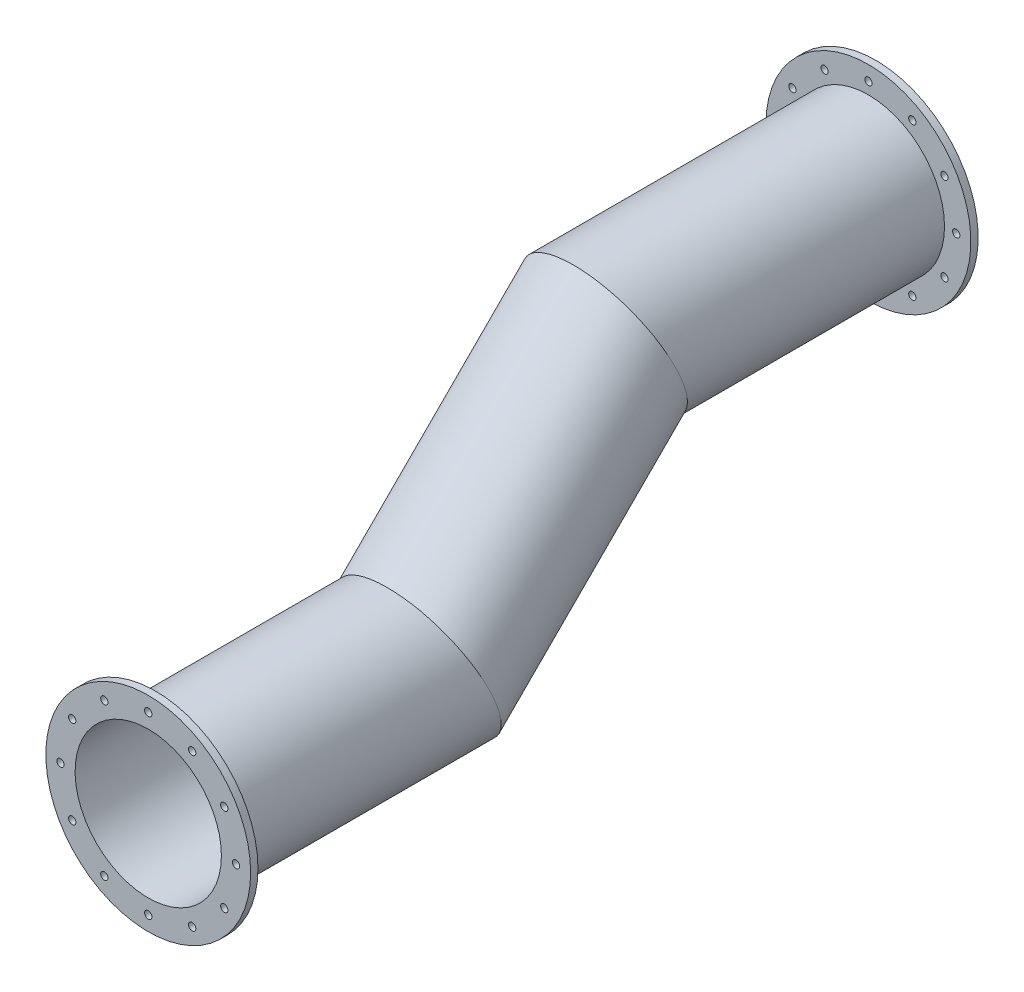
ISO-10303-21;
HEADER;
FILE_DESCRIPTION(('STEP AP214'),'2;1');
FILE_NAME('part.step','',(''),(''),'','','');
FILE_SCHEMA(('AUTOMOTIVE_DESIGN { 1 0 10303 214 1 1 1 1 }'));
ENDSEC;
DATA;
#1=APPLICATION_CONTEXT('core data for automotive mechanical design processes');
#2=APPLICATION_PROTOCOL_DEFINITION('international standard','automotive_design',2000,#1);
#3=PRODUCT_CONTEXT('',#1,'mechanical');
#4=PRODUCT('Part','Part','',(#3));
#5=PRODUCT_RELATED_PRODUCT_CATEGORY('part','',(#4));
#6=PRODUCT_DEFINITION_FORMATION('','',#4);
#7=PRODUCT_DEFINITION_CONTEXT('part definition',#1,'design');
#8=PRODUCT_DEFINITION('design','',#6,#7);
#9=PRODUCT_DEFINITION_SHAPE('','',#8);
#10=(LENGTH_UNIT() NAMED_UNIT(*) SI_UNIT(.MILLI.,.METRE.));
#11=(NAMED_UNIT(*) PLANE_ANGLE_UNIT() SI_UNIT($,.RADIAN.));
#12=(NAMED_UNIT(*) SI_UNIT($,.STERADIAN.) SOLID_ANGLE_UNIT());
#13=UNCERTAINTY_MEASURE_WITH_UNIT(LENGTH_MEASURE(1.E-05),#10,'distance_accuracy_value','');
#14=(GEOMETRIC_REPRESENTATION_CONTEXT(3) GLOBAL_UNCERTAINTY_ASSIGNED_CONTEXT((#13)) GLOBAL_UNIT_ASSIGNED_CONTEXT((#10,
#11,#12)) REPRESENTATION_CONTEXT('',''));
#15=CARTESIAN_POINT('',(0.,0.,0.));
#16=DIRECTION('',(0.,0.,1.));
#17=DIRECTION('',(1.,0.,0.));
#18=AXIS2_PLACEMENT_3D('',#15,#16,#17);
#19=CARTESIAN_POINT('',(0.,127.279220613579,-261.615728752538));
#20=DIRECTION('',(0.,0.,-1.));
#21=DIRECTION('',(-1.,0.,0.));
#22=AXIS2_PLACEMENT_3D('',#19,#20,#21);
#23=CYLINDRICAL_SURFACE('',#22,52.);
#24=CARTESIAN_POINT('',(0.,127.279220613579,-307.279220613579));
#25=DIRECTION('',(0.,0.38268343236509,-0.923879532511287));
#26=DIRECTION('',(0.,0.923879532511287,0.38268343236509));
#27=AXIS2_PLACEMENT_3D('',#24,#25,#26);
#28=ELLIPSE('',#27,56.2843944152045,52.);
#29=CARTESIAN_POINT('',(0.,179.279220613579,-285.740115370178));
#30=VERTEX_POINT('',#29);
#31=EDGE_CURVE('E51',#30,#30,#28,.T.);
#32=ORIENTED_EDGE('',*,*,#31,.T.);
#33=EDGE_LOOP('',(#32));
#34=FACE_BOUND('',#33,.T.);
#35=CARTESIAN_POINT('',(0.,127.279220613579,-487.279220613578));
#36=DIRECTION('',(0.,0.,1.));
#37=DIRECTION('',(1.,0.,0.));
#38=AXIS2_PLACEMENT_3D('',#35,#36,#37);
#39=CIRCLE('',#38,52.);
#40=CARTESIAN_POINT('',(52.,127.279220613579,-487.279220613578));
#41=VERTEX_POINT('',#40);
#42=EDGE_CURVE('E54',#41,#41,#39,.T.);
#43=ORIENTED_EDGE('',*,*,#42,.T.);
#44=EDGE_LOOP('',(#43));
#45=FACE_BOUND('',#44,.T.);
#46=ADVANCED_FACE('F37',(#34,#45),#23,.T.);
#47=CARTESIAN_POINT('',(0.,-32.2889647475984,-147.711035252402));
#48=DIRECTION('',(0.,0.707106781186548,-0.707106781186547));
#49=DIRECTION('',(0.,0.707106781186547,0.707106781186548));
#50=AXIS2_PLACEMENT_3D('',#47,#48,#49);
#51=CYLINDRICAL_SURFACE('',#50,52.);
#52=CARTESIAN_POINT('',(0.,0.,-180.));
#53=DIRECTION('',(0.,0.38268343236509,-0.923879532511287));
#54=DIRECTION('',(0.,-0.923879532511287,-0.38268343236509));
#55=AXIS2_PLACEMENT_3D('',#52,#53,#54);
#56=ELLIPSE('',#55,56.2843944152045,52.);
#57=CARTESIAN_POINT('',(0.,-52.,-201.539105243401));
#58=VERTEX_POINT('',#57);
#59=EDGE_CURVE('E10',#58,#58,#56,.T.);
#60=ORIENTED_EDGE('',*,*,#59,.T.);
#61=EDGE_LOOP('',(#60));
#62=FACE_BOUND('',#61,.T.);
#63=ORIENTED_EDGE('',*,*,#31,.F.);
#64=EDGE_LOOP('',(#63));
#65=FACE_BOUND('',#64,.T.);
#66=ADVANCED_FACE('F322',(#62,#65),#51,.T.);
#67=CARTESIAN_POINT('',(0.,0.,0.));
#68=DIRECTION('',(0.,0.,-1.));
#69=DIRECTION('',(-1.,0.,0.));
#70=AXIS2_PLACEMENT_3D('',#67,#68,#69);
#71=CYLINDRICAL_SURFACE('',#70,52.);
#72=CARTESIAN_POINT('',(0.,0.,0.));
#73=DIRECTION('',(0.,0.,1.));
#74=DIRECTION('',(1.,0.,0.));
#75=AXIS2_PLACEMENT_3D('',#72,#73,#74);
#76=CIRCLE('',#75,52.);
#77=CARTESIAN_POINT('',(52.,0.,0.));
#78=VERTEX_POINT('',#77);
#79=EDGE_CURVE('E41',#78,#78,#76,.T.);
#80=ORIENTED_EDGE('',*,*,#79,.F.);
#81=EDGE_LOOP('',(#80));
#82=FACE_BOUND('',#81,.T.);
#83=ORIENTED_EDGE('',*,*,#59,.F.);
#84=EDGE_LOOP('',(#83));
#85=FACE_BOUND('',#84,.T.);
#86=ADVANCED_FACE('F39',(#82,#85),#71,.T.);
#87=CARTESIAN_POINT('',(0.,127.279220613579,-261.615728752538));
#88=DIRECTION('',(0.,0.,-1.));
#89=DIRECTION('',(-1.,0.,0.));
#90=AXIS2_PLACEMENT_3D('',#87,#88,#89);
#91=CYLINDRICAL_SURFACE('',#90,50.);
#92=CARTESIAN_POINT('',(0.,127.279220613579,-307.279220613579));
#93=DIRECTION('',(0.,0.38268343236509,-0.923879532511287));
#94=DIRECTION('',(0.,0.923879532511287,0.38268343236509));
#95=AXIS2_PLACEMENT_3D('',#92,#93,#94);
#96=ELLIPSE('',#95,54.1196100146197,50.);
#97=CARTESIAN_POINT('',(0.,177.279220613579,-286.568542494924));
#98=VERTEX_POINT('',#97);
#99=EDGE_CURVE('E178',#98,#98,#96,.T.);
#100=ORIENTED_EDGE('',*,*,#99,.F.);
#101=EDGE_LOOP('',(#100));
#102=FACE_BOUND('',#101,.T.);
#103=CARTESIAN_POINT('',(0.,127.279220613579,-492.279220613578));
#104=DIRECTION('',(0.,0.,-1.));
#105=DIRECTION('',(-1.,0.,0.));
#106=AXIS2_PLACEMENT_3D('',#103,#104,#105);
#107=CIRCLE('',#106,50.);
#108=CARTESIAN_POINT('',(-50.,127.279220613579,-492.279220613578));
#109=VERTEX_POINT('',#108);
#110=EDGE_CURVE('E73',#109,#109,#107,.T.);
#111=ORIENTED_EDGE('',*,*,#110,.T.);
#112=EDGE_LOOP('',(#111));
#113=FACE_BOUND('',#112,.T.);
#114=ADVANCED_FACE('F191',(#102,#113),#91,.F.);
#115=CARTESIAN_POINT('',(0.,-32.2889647475984,-147.711035252402));
#116=DIRECTION('',(0.,0.707106781186548,-0.707106781186547));
#117=DIRECTION('',(0.,0.707106781186547,0.707106781186548));
#118=AXIS2_PLACEMENT_3D('',#115,#116,#117);
#119=CYLINDRICAL_SURFACE('',#118,50.);
#120=CARTESIAN_POINT('',(0.,0.,-180.));
#121=DIRECTION('',(0.,0.38268343236509,-0.923879532511287));
#122=DIRECTION('',(0.,-0.923879532511287,-0.38268343236509));
#123=AXIS2_PLACEMENT_3D('',#120,#121,#122);
#124=ELLIPSE('',#123,54.1196100146197,50.);
#125=CARTESIAN_POINT('',(0.,-50.,-200.710678118655));
#126=VERTEX_POINT('',#125);
#127=EDGE_CURVE('E182',#126,#126,#124,.T.);
#128=ORIENTED_EDGE('',*,*,#127,.F.);
#129=EDGE_LOOP('',(#128));
#130=FACE_BOUND('',#129,.T.);
#131=ORIENTED_EDGE('',*,*,#99,.T.);
#132=EDGE_LOOP('',(#131));
#133=FACE_BOUND('',#132,.T.);
#134=ADVANCED_FACE('F189',(#130,#133),#119,.F.);
#135=CARTESIAN_POINT('',(0.,0.,0.));
#136=DIRECTION('',(0.,0.,-1.));
#137=DIRECTION('',(-1.,0.,0.));
#138=AXIS2_PLACEMENT_3D('',#135,#136,#137);
#139=CYLINDRICAL_SURFACE('',#138,50.);
#140=ORIENTED_EDGE('',*,*,#127,.T.);
#141=EDGE_LOOP('',(#140));
#142=FACE_BOUND('',#141,.T.);
#143=CARTESIAN_POINT('',(0.,0.,5.));
#144=DIRECTION('',(0.,0.,1.));
#145=DIRECTION('',(1.,0.,0.));
#146=AXIS2_PLACEMENT_3D('',#143,#144,#145);
#147=CIRCLE('',#146,50.);
#148=CARTESIAN_POINT('',(50.,0.,5.));
#149=VERTEX_POINT('',#148);
#150=EDGE_CURVE('E166',#149,#149,#147,.T.);
#151=ORIENTED_EDGE('',*,*,#150,.T.);
#152=EDGE_LOOP('',(#151));
#153=FACE_BOUND('',#152,.T.);
#154=ADVANCED_FACE('F411',(#142,#153),#139,.F.);
#155=CARTESIAN_POINT('',(0.,0.,5.));
#156=DIRECTION('',(0.,0.,1.));
#157=DIRECTION('',(1.,0.,0.));
#158=AXIS2_PLACEMENT_3D('',#155,#156,#157);
#159=PLANE('',#158);
#160=CARTESIAN_POINT('',(51.9615242270663,-30.,5.));
#161=DIRECTION('',(0.,0.,1.));
#162=DIRECTION('',(1.,0.,0.));
#163=AXIS2_PLACEMENT_3D('',#160,#161,#162);
#164=CIRCLE('',#163,2.5);
#165=CARTESIAN_POINT('',(54.4615242270663,-30.,5.));
#166=VERTEX_POINT('',#165);
#167=EDGE_CURVE('E82',#166,#166,#164,.T.);
#168=ORIENTED_EDGE('',*,*,#167,.F.);
#169=EDGE_LOOP('',(#168));
#170=FACE_BOUND('',#169,.T.);
#171=CARTESIAN_POINT('',(51.9615242270663,30.,5.));
#172=DIRECTION('',(0.,0.,1.));
#173=DIRECTION('',(1.,0.,0.));
#174=AXIS2_PLACEMENT_3D('',#171,#172,#173);
#175=CIRCLE('',#174,2.50000000000001);
#176=CARTESIAN_POINT('',(54.4615242270663,30.,5.));
#177=VERTEX_POINT('',#176);
#178=EDGE_CURVE('E98',#177,#177,#175,.T.);
#179=ORIENTED_EDGE('',*,*,#178,.F.);
#180=EDGE_LOOP('',(#179));
#181=FACE_BOUND('',#180,.T.);
#182=CARTESIAN_POINT('',(0.,60.,5.));
#183=DIRECTION('',(0.,0.,1.));
#184=DIRECTION('',(1.,0.,0.));
#185=AXIS2_PLACEMENT_3D('',#182,#183,#184);
#186=CIRCLE('',#185,2.5);
#187=CARTESIAN_POINT('',(2.5,60.,5.));
#188=VERTEX_POINT('',#187);
#189=EDGE_CURVE('E114',#188,#188,#186,.T.);
#190=ORIENTED_EDGE('',*,*,#189,.F.);
#191=EDGE_LOOP('',(#190));
#192=FACE_BOUND('',#191,.T.);
#193=CARTESIAN_POINT('',(-51.9615242270663,30.,5.));
#194=DIRECTION('',(0.,0.,1.));
#195=DIRECTION('',(1.,0.,0.));
#196=AXIS2_PLACEMENT_3D('',#193,#194,#195);
#197=CIRCLE('',#196,2.5);
#198=CARTESIAN_POINT('',(-49.4615242270663,30.,5.));
#199=VERTEX_POINT('',#198);
#200=EDGE_CURVE('E130',#199,#199,#197,.T.);
#201=ORIENTED_EDGE('',*,*,#200,.F.);
#202=EDGE_LOOP('',(#201));
#203=FACE_BOUND('',#202,.T.);
#204=CARTESIAN_POINT('',(-51.9615242270663,-30.,5.));
#205=DIRECTION('',(0.,0.,1.));
#206=DIRECTION('',(1.,0.,0.));
#207=AXIS2_PLACEMENT_3D('',#204,#205,#206);
#208=CIRCLE('',#207,2.50000000000001);
#209=CARTESIAN_POINT('',(-49.4615242270663,-30.,5.));
#210=VERTEX_POINT('',#209);
#211=EDGE_CURVE('E146',#210,#210,#208,.T.);
#212=ORIENTED_EDGE('',*,*,#211,.F.);
#213=EDGE_LOOP('',(#212));
#214=FACE_BOUND('',#213,.T.);
#215=CARTESIAN_POINT('',(0.,-60.,5.));
#216=DIRECTION('',(0.,0.,1.));
#217=DIRECTION('',(1.,0.,0.));
#218=AXIS2_PLACEMENT_3D('',#215,#216,#217);
#219=CIRCLE('',#218,2.5);
#220=CARTESIAN_POINT('',(2.5,-60.,5.));
#221=VERTEX_POINT('',#220);
#222=EDGE_CURVE('E162',#221,#221,#219,.T.);
#223=ORIENTED_EDGE('',*,*,#222,.F.);
#224=EDGE_LOOP('',(#223));
#225=FACE_BOUND('',#224,.T.);
#226=CARTESIAN_POINT('',(0.,0.,5.));
#227=DIRECTION('',(0.,0.,1.));
#228=DIRECTION('',(1.,0.,0.));
#229=AXIS2_PLACEMENT_3D('',#226,#227,#228);
#230=CIRCLE('',#229,70.0000000000001);
#231=CARTESIAN_POINT('',(70.0000000000001,0.,5.));
#232=VERTEX_POINT('',#231);
#233=EDGE_CURVE('E174',#232,#232,#230,.T.);
#234=ORIENTED_EDGE('',*,*,#233,.T.);
#235=EDGE_LOOP('',(#234));
#236=FACE_BOUND('',#235,.T.);
#237=ORIENTED_EDGE('',*,*,#150,.F.);
#238=EDGE_LOOP('',(#237));
#239=FACE_BOUND('',#238,.T.);
#240=CARTESIAN_POINT('',(-30.,-51.9615242270663,5.));
#241=DIRECTION('',(0.,0.,1.));
#242=DIRECTION('',(1.,0.,0.));
#243=AXIS2_PLACEMENT_3D('',#240,#241,#242);
#244=CIRCLE('',#243,2.5);
#245=CARTESIAN_POINT('',(-27.5,-51.9615242270663,5.));
#246=VERTEX_POINT('',#245);
#247=EDGE_CURVE('E154',#246,#246,#244,.T.);
#248=ORIENTED_EDGE('',*,*,#247,.F.);
#249=EDGE_LOOP('',(#248));
#250=FACE_BOUND('',#249,.T.);
#251=CARTESIAN_POINT('',(-60.,0.,5.));
#252=DIRECTION('',(0.,0.,1.));
#253=DIRECTION('',(1.,0.,0.));
#254=AXIS2_PLACEMENT_3D('',#251,#252,#253);
#255=CIRCLE('',#254,2.5);
#256=CARTESIAN_POINT('',(-57.5,0.,5.));
#257=VERTEX_POINT('',#256);
#258=EDGE_CURVE('E138',#257,#257,#255,.T.);
#259=ORIENTED_EDGE('',*,*,#258,.F.);
#260=EDGE_LOOP('',(#259));
#261=FACE_BOUND('',#260,.T.);
#262=CARTESIAN_POINT('',(-30.,51.9615242270663,5.));
#263=DIRECTION('',(0.,0.,1.));
#264=DIRECTION('',(1.,0.,0.));
#265=AXIS2_PLACEMENT_3D('',#262,#263,#264);
#266=CIRCLE('',#265,2.5);
#267=CARTESIAN_POINT('',(-27.5,51.9615242270663,5.));
#268=VERTEX_POINT('',#267);
#269=EDGE_CURVE('E122',#268,#268,#266,.T.);
#270=ORIENTED_EDGE('',*,*,#269,.F.);
#271=EDGE_LOOP('',(#270));
#272=FACE_BOUND('',#271,.T.);
#273=CARTESIAN_POINT('',(30.,51.9615242270663,5.));
#274=DIRECTION('',(0.,0.,1.));
#275=DIRECTION('',(1.,0.,0.));
#276=AXIS2_PLACEMENT_3D('',#273,#274,#275);
#277=CIRCLE('',#276,2.50000000000001);
#278=CARTESIAN_POINT('',(32.5,51.9615242270663,5.));
#279=VERTEX_POINT('',#278);
#280=EDGE_CURVE('E106',#279,#279,#277,.T.);
#281=ORIENTED_EDGE('',*,*,#280,.F.);
#282=EDGE_LOOP('',(#281));
#283=FACE_BOUND('',#282,.T.);
#284=CARTESIAN_POINT('',(60.,0.,5.));
#285=DIRECTION('',(0.,0.,1.));
#286=DIRECTION('',(1.,0.,0.));
#287=AXIS2_PLACEMENT_3D('',#284,#285,#286);
#288=CIRCLE('',#287,2.5);
#289=CARTESIAN_POINT('',(62.5,0.,5.));
#290=VERTEX_POINT('',#289);
#291=EDGE_CURVE('E90',#290,#290,#288,.T.);
#292=ORIENTED_EDGE('',*,*,#291,.F.);
#293=EDGE_LOOP('',(#292));
#294=FACE_BOUND('',#293,.T.);
#295=CARTESIAN_POINT('',(30.,-51.9615242270663,5.));
#296=DIRECTION('',(0.,0.,1.));
#297=DIRECTION('',(1.,0.,0.));
#298=AXIS2_PLACEMENT_3D('',#295,#296,#297);
#299=CIRCLE('',#298,2.5);
#300=CARTESIAN_POINT('',(32.5,-51.9615242270663,5.));
#301=VERTEX_POINT('',#300);
#302=EDGE_CURVE('E64',#301,#301,#299,.T.);
#303=ORIENTED_EDGE('',*,*,#302,.F.);
#304=EDGE_LOOP('',(#303));
#305=FACE_BOUND('',#304,.T.);
#306=ADVANCED_FACE('F195',(#170,#181,#192,#203,#214,#225,#236,#239,#250,#261,#272,#283,#294,
#305),#159,.T.);
#307=CARTESIAN_POINT('',(0.,0.,0.));
#308=DIRECTION('',(0.,0.,1.));
#309=DIRECTION('',(1.,0.,0.));
#310=AXIS2_PLACEMENT_3D('',#307,#308,#309);
#311=PLANE('',#310);
#312=ORIENTED_EDGE('',*,*,#79,.T.);
#313=EDGE_LOOP('',(#312));
#314=FACE_BOUND('',#313,.T.);
#315=CARTESIAN_POINT('',(0.,0.,0.));
#316=DIRECTION('',(0.,0.,1.));
#317=DIRECTION('',(1.,0.,0.));
#318=AXIS2_PLACEMENT_3D('',#315,#316,#317);
#319=CIRCLE('',#318,70.0000000000001);
#320=CARTESIAN_POINT('',(70.0000000000001,0.,0.));
#321=VERTEX_POINT('',#320);
#322=EDGE_CURVE('E173',#321,#321,#319,.T.);
#323=ORIENTED_EDGE('',*,*,#322,.F.);
#324=EDGE_LOOP('',(#323));
#325=FACE_BOUND('',#324,.T.);
#326=CARTESIAN_POINT('',(0.,-60.,0.));
#327=DIRECTION('',(0.,0.,1.));
#328=DIRECTION('',(1.,0.,0.));
#329=AXIS2_PLACEMENT_3D('',#326,#327,#328);
#330=CIRCLE('',#329,2.5);
#331=CARTESIAN_POINT('',(2.5,-60.,0.));
#332=VERTEX_POINT('',#331);
#333=EDGE_CURVE('E158',#332,#332,#330,.T.);
#334=ORIENTED_EDGE('',*,*,#333,.T.);
#335=EDGE_LOOP('',(#334));
#336=FACE_BOUND('',#335,.T.);
#337=CARTESIAN_POINT('',(-30.,-51.9615242270663,0.));
#338=DIRECTION('',(0.,0.,1.));
#339=DIRECTION('',(1.,0.,0.));
#340=AXIS2_PLACEMENT_3D('',#337,#338,#339);
#341=CIRCLE('',#340,2.5);
#342=CARTESIAN_POINT('',(-27.5,-51.9615242270663,0.));
#343=VERTEX_POINT('',#342);
#344=EDGE_CURVE('E150',#343,#343,#341,.T.);
#345=ORIENTED_EDGE('',*,*,#344,.T.);
#346=EDGE_LOOP('',(#345));
#347=FACE_BOUND('',#346,.T.);
#348=CARTESIAN_POINT('',(-51.9615242270663,-30.,0.));
#349=DIRECTION('',(0.,0.,1.));
#350=DIRECTION('',(1.,0.,0.));
#351=AXIS2_PLACEMENT_3D('',#348,#349,#350);
#352=CIRCLE('',#351,2.50000000000001);
#353=CARTESIAN_POINT('',(-49.4615242270663,-30.,0.));
#354=VERTEX_POINT('',#353);
#355=EDGE_CURVE('E142',#354,#354,#352,.T.);
#356=ORIENTED_EDGE('',*,*,#355,.T.);
#357=EDGE_LOOP('',(#356));
#358=FACE_BOUND('',#357,.T.);
#359=CARTESIAN_POINT('',(-60.,0.,0.));
#360=DIRECTION('',(0.,0.,1.));
#361=DIRECTION('',(1.,0.,0.));
#362=AXIS2_PLACEMENT_3D('',#359,#360,#361);
#363=CIRCLE('',#362,2.5);
#364=CARTESIAN_POINT('',(-57.5,0.,0.));
#365=VERTEX_POINT('',#364);
#366=EDGE_CURVE('E134',#365,#365,#363,.T.);
#367=ORIENTED_EDGE('',*,*,#366,.T.);
#368=EDGE_LOOP('',(#367));
#369=FACE_BOUND('',#368,.T.);
#370=CARTESIAN_POINT('',(-51.9615242270663,30.,0.));
#371=DIRECTION('',(0.,0.,1.));
#372=DIRECTION('',(1.,0.,0.));
#373=AXIS2_PLACEMENT_3D('',#370,#371,#372);
#374=CIRCLE('',#373,2.5);
#375=CARTESIAN_POINT('',(-49.4615242270663,30.,0.));
#376=VERTEX_POINT('',#375);
#377=EDGE_CURVE('E126',#376,#376,#374,.T.);
#378=ORIENTED_EDGE('',*,*,#377,.T.);
#379=EDGE_LOOP('',(#378));
#380=FACE_BOUND('',#379,.T.);
#381=CARTESIAN_POINT('',(-30.,51.9615242270663,0.));
#382=DIRECTION('',(0.,0.,1.));
#383=DIRECTION('',(1.,0.,0.));
#384=AXIS2_PLACEMENT_3D('',#381,#382,#383);
#385=CIRCLE('',#384,2.5);
#386=CARTESIAN_POINT('',(-27.5,51.9615242270663,0.));
#387=VERTEX_POINT('',#386);
#388=EDGE_CURVE('E118',#387,#387,#385,.T.);
#389=ORIENTED_EDGE('',*,*,#388,.T.);
#390=EDGE_LOOP('',(#389));
#391=FACE_BOUND('',#390,.T.);
#392=CARTESIAN_POINT('',(0.,60.,0.));
#393=DIRECTION('',(0.,0.,1.));
#394=DIRECTION('',(1.,0.,0.));
#395=AXIS2_PLACEMENT_3D('',#392,#393,#394);
#396=CIRCLE('',#395,2.5);
#397=CARTESIAN_POINT('',(2.5,60.,0.));
#398=VERTEX_POINT('',#397);
#399=EDGE_CURVE('E110',#398,#398,#396,.T.);
#400=ORIENTED_EDGE('',*,*,#399,.T.);
#401=EDGE_LOOP('',(#400));
#402=FACE_BOUND('',#401,.T.);
#403=CARTESIAN_POINT('',(30.,51.9615242270663,0.));
#404=DIRECTION('',(0.,0.,1.));
#405=DIRECTION('',(1.,0.,0.));
#406=AXIS2_PLACEMENT_3D('',#403,#404,#405);
#407=CIRCLE('',#406,2.50000000000001);
#408=CARTESIAN_POINT('',(32.5,51.9615242270663,0.));
#409=VERTEX_POINT('',#408);
#410=EDGE_CURVE('E102',#409,#409,#407,.T.);
#411=ORIENTED_EDGE('',*,*,#410,.T.);
#412=EDGE_LOOP('',(#411));
#413=FACE_BOUND('',#412,.T.);
#414=CARTESIAN_POINT('',(51.9615242270663,30.,0.));
#415=DIRECTION('',(0.,0.,1.));
#416=DIRECTION('',(1.,0.,0.));
#417=AXIS2_PLACEMENT_3D('',#414,#415,#416);
#418=CIRCLE('',#417,2.50000000000001);
#419=CARTESIAN_POINT('',(54.4615242270663,30.,0.));
#420=VERTEX_POINT('',#419);
#421=EDGE_CURVE('E94',#420,#420,#418,.T.);
#422=ORIENTED_EDGE('',*,*,#421,.T.);
#423=EDGE_LOOP('',(#422));
#424=FACE_BOUND('',#423,.T.);
#425=CARTESIAN_POINT('',(60.,0.,0.));
#426=DIRECTION('',(0.,0.,1.));
#427=DIRECTION('',(1.,0.,0.));
#428=AXIS2_PLACEMENT_3D('',#425,#426,#427);
#429=CIRCLE('',#428,2.5);
#430=CARTESIAN_POINT('',(62.5,0.,0.));
#431=VERTEX_POINT('',#430);
#432=EDGE_CURVE('E86',#431,#431,#429,.T.);
#433=ORIENTED_EDGE('',*,*,#432,.T.);
#434=EDGE_LOOP('',(#433));
#435=FACE_BOUND('',#434,.T.);
#436=CARTESIAN_POINT('',(51.9615242270663,-30.,0.));
#437=DIRECTION('',(0.,0.,1.));
#438=DIRECTION('',(1.,0.,0.));
#439=AXIS2_PLACEMENT_3D('',#436,#437,#438);
#440=CIRCLE('',#439,2.5);
#441=CARTESIAN_POINT('',(54.4615242270663,-30.,0.));
#442=VERTEX_POINT('',#441);
#443=EDGE_CURVE('E80',#442,#442,#440,.T.);
#444=ORIENTED_EDGE('',*,*,#443,.T.);
#445=EDGE_LOOP('',(#444));
#446=FACE_BOUND('',#445,.T.);
#447=CARTESIAN_POINT('',(30.,-51.9615242270663,0.));
#448=DIRECTION('',(0.,0.,1.));
#449=DIRECTION('',(1.,0.,0.));
#450=AXIS2_PLACEMENT_3D('',#447,#448,#449);
#451=CIRCLE('',#450,2.5);
#452=CARTESIAN_POINT('',(32.5,-51.9615242270663,0.));
#453=VERTEX_POINT('',#452);
#454=EDGE_CURVE('E57',#453,#453,#451,.T.);
#455=ORIENTED_EDGE('',*,*,#454,.T.);
#456=EDGE_LOOP('',(#455));
#457=FACE_BOUND('',#456,.T.);
#458=ADVANCED_FACE('F331',(#314,#325,#336,#347,#358,#369,#380,#391,#402,#413,#424,#435,#446,
#457),#311,.F.);
#459=CARTESIAN_POINT('',(0.,0.,5.));
#460=DIRECTION('',(0.,0.,-1.));
#461=DIRECTION('',(-1.,0.,0.));
#462=AXIS2_PLACEMENT_3D('',#459,#460,#461);
#463=CYLINDRICAL_SURFACE('',#462,70.0000000000001);
#464=ORIENTED_EDGE('',*,*,#233,.F.);
#465=EDGE_LOOP('',(#464));
#466=FACE_BOUND('',#465,.T.);
#467=ORIENTED_EDGE('',*,*,#322,.T.);
#468=EDGE_LOOP('',(#467));
#469=FACE_BOUND('',#468,.T.);
#470=ADVANCED_FACE('F334',(#466,#469),#463,.T.);
#471=CARTESIAN_POINT('',(0.,-60.,5.));
#472=DIRECTION('',(0.,0.,-1.));
#473=DIRECTION('',(-1.,0.,0.));
#474=AXIS2_PLACEMENT_3D('',#471,#472,#473);
#475=CYLINDRICAL_SURFACE('',#474,2.5);
#476=ORIENTED_EDGE('',*,*,#222,.T.);
#477=EDGE_LOOP('',(#476));
#478=FACE_BOUND('',#477,.T.);
#479=ORIENTED_EDGE('',*,*,#333,.F.);
#480=EDGE_LOOP('',(#479));
#481=FACE_BOUND('',#480,.T.);
#482=ADVANCED_FACE('F405',(#478,#481),#475,.F.);
#483=CARTESIAN_POINT('',(-30.,-51.9615242270663,5.));
#484=DIRECTION('',(0.,0.,-1.));
#485=DIRECTION('',(-1.,0.,0.));
#486=AXIS2_PLACEMENT_3D('',#483,#484,#485);
#487=CYLINDRICAL_SURFACE('',#486,2.5);
#488=ORIENTED_EDGE('',*,*,#247,.T.);
#489=EDGE_LOOP('',(#488));
#490=FACE_BOUND('',#489,.T.);
#491=ORIENTED_EDGE('',*,*,#344,.F.);
#492=EDGE_LOOP('',(#491));
#493=FACE_BOUND('',#492,.T.);
#494=ADVANCED_FACE('F401',(#490,#493),#487,.F.);
#495=CARTESIAN_POINT('',(-51.9615242270663,-30.,5.));
#496=DIRECTION('',(0.,0.,-1.));
#497=DIRECTION('',(-1.,0.,0.));
#498=AXIS2_PLACEMENT_3D('',#495,#496,#497);
#499=CYLINDRICAL_SURFACE('',#498,2.50000000000001);
#500=ORIENTED_EDGE('',*,*,#211,.T.);
#501=EDGE_LOOP('',(#500));
#502=FACE_BOUND('',#501,.T.);
#503=ORIENTED_EDGE('',*,*,#355,.F.);
#504=EDGE_LOOP('',(#503));
#505=FACE_BOUND('',#504,.T.);
#506=ADVANCED_FACE('F397',(#502,#505),#499,.F.);
#507=CARTESIAN_POINT('',(-60.,0.,5.));
#508=DIRECTION('',(0.,0.,-1.));
#509=DIRECTION('',(-1.,0.,0.));
#510=AXIS2_PLACEMENT_3D('',#507,#508,#509);
#511=CYLINDRICAL_SURFACE('',#510,2.5);
#512=ORIENTED_EDGE('',*,*,#258,.T.);
#513=EDGE_LOOP('',(#512));
#514=FACE_BOUND('',#513,.T.);
#515=ORIENTED_EDGE('',*,*,#366,.F.);
#516=EDGE_LOOP('',(#515));
#517=FACE_BOUND('',#516,.T.);
#518=ADVANCED_FACE('F393',(#514,#517),#511,.F.);
#519=CARTESIAN_POINT('',(-51.9615242270663,30.,5.));
#520=DIRECTION('',(0.,0.,-1.));
#521=DIRECTION('',(-1.,0.,0.));
#522=AXIS2_PLACEMENT_3D('',#519,#520,#521);
#523=CYLINDRICAL_SURFACE('',#522,2.5);
#524=ORIENTED_EDGE('',*,*,#200,.T.);
#525=EDGE_LOOP('',(#524));
#526=FACE_BOUND('',#525,.T.);
#527=ORIENTED_EDGE('',*,*,#377,.F.);
#528=EDGE_LOOP('',(#527));
#529=FACE_BOUND('',#528,.T.);
#530=ADVANCED_FACE('F389',(#526,#529),#523,.F.);
#531=CARTESIAN_POINT('',(-30.,51.9615242270663,5.));
#532=DIRECTION('',(0.,0.,-1.));
#533=DIRECTION('',(-1.,0.,0.));
#534=AXIS2_PLACEMENT_3D('',#531,#532,#533);
#535=CYLINDRICAL_SURFACE('',#534,2.5);
#536=ORIENTED_EDGE('',*,*,#269,.T.);
#537=EDGE_LOOP('',(#536));
#538=FACE_BOUND('',#537,.T.);
#539=ORIENTED_EDGE('',*,*,#388,.F.);
#540=EDGE_LOOP('',(#539));
#541=FACE_BOUND('',#540,.T.);
#542=ADVANCED_FACE('F385',(#538,#541),#535,.F.);
#543=CARTESIAN_POINT('',(0.,60.,5.));
#544=DIRECTION('',(0.,0.,-1.));
#545=DIRECTION('',(-1.,0.,0.));
#546=AXIS2_PLACEMENT_3D('',#543,#544,#545);
#547=CYLINDRICAL_SURFACE('',#546,2.5);
#548=ORIENTED_EDGE('',*,*,#189,.T.);
#549=EDGE_LOOP('',(#548));
#550=FACE_BOUND('',#549,.T.);
#551=ORIENTED_EDGE('',*,*,#399,.F.);
#552=EDGE_LOOP('',(#551));
#553=FACE_BOUND('',#552,.T.);
#554=ADVANCED_FACE('F381',(#550,#553),#547,.F.);
#555=CARTESIAN_POINT('',(30.,51.9615242270663,5.));
#556=DIRECTION('',(0.,0.,-1.));
#557=DIRECTION('',(-1.,0.,0.));
#558=AXIS2_PLACEMENT_3D('',#555,#556,#557);
#559=CYLINDRICAL_SURFACE('',#558,2.50000000000001);
#560=ORIENTED_EDGE('',*,*,#280,.T.);
#561=EDGE_LOOP('',(#560));
#562=FACE_BOUND('',#561,.T.);
#563=ORIENTED_EDGE('',*,*,#410,.F.);
#564=EDGE_LOOP('',(#563));
#565=FACE_BOUND('',#564,.T.);
#566=ADVANCED_FACE('F377',(#562,#565),#559,.F.);
#567=CARTESIAN_POINT('',(51.9615242270663,30.,5.));
#568=DIRECTION('',(0.,0.,-1.));
#569=DIRECTION('',(-1.,0.,0.));
#570=AXIS2_PLACEMENT_3D('',#567,#568,#569);
#571=CYLINDRICAL_SURFACE('',#570,2.50000000000001);
#572=ORIENTED_EDGE('',*,*,#178,.T.);
#573=EDGE_LOOP('',(#572));
#574=FACE_BOUND('',#573,.T.);
#575=ORIENTED_EDGE('',*,*,#421,.F.);
#576=EDGE_LOOP('',(#575));
#577=FACE_BOUND('',#576,.T.);
#578=ADVANCED_FACE('F370',(#574,#577),#571,.F.);
#579=CARTESIAN_POINT('',(60.,0.,5.));
#580=DIRECTION('',(0.,0.,-1.));
#581=DIRECTION('',(-1.,0.,0.));
#582=AXIS2_PLACEMENT_3D('',#579,#580,#581);
#583=CYLINDRICAL_SURFACE('',#582,2.5);
#584=ORIENTED_EDGE('',*,*,#291,.T.);
#585=EDGE_LOOP('',(#584));
#586=FACE_BOUND('',#585,.T.);
#587=ORIENTED_EDGE('',*,*,#432,.F.);
#588=EDGE_LOOP('',(#587));
#589=FACE_BOUND('',#588,.T.);
#590=ADVANCED_FACE('F364',(#586,#589),#583,.F.);
#591=CARTESIAN_POINT('',(51.9615242270663,-30.,5.));
#592=DIRECTION('',(0.,0.,-1.));
#593=DIRECTION('',(-1.,0.,0.));
#594=AXIS2_PLACEMENT_3D('',#591,#592,#593);
#595=CYLINDRICAL_SURFACE('',#594,2.5);
#596=ORIENTED_EDGE('',*,*,#167,.T.);
#597=EDGE_LOOP('',(#596));
#598=FACE_BOUND('',#597,.T.);
#599=ORIENTED_EDGE('',*,*,#443,.F.);
#600=EDGE_LOOP('',(#599));
#601=FACE_BOUND('',#600,.T.);
#602=ADVANCED_FACE('F315',(#598,#601),#595,.F.);
#603=CARTESIAN_POINT('',(30.,-51.9615242270663,5.));
#604=DIRECTION('',(0.,0.,-1.));
#605=DIRECTION('',(-1.,0.,0.));
#606=AXIS2_PLACEMENT_3D('',#603,#604,#605);
#607=CYLINDRICAL_SURFACE('',#606,2.5);
#608=ORIENTED_EDGE('',*,*,#302,.T.);
#609=EDGE_LOOP('',(#608));
#610=FACE_BOUND('',#609,.T.);
#611=ORIENTED_EDGE('',*,*,#454,.F.);
#612=EDGE_LOOP('',(#611));
#613=FACE_BOUND('',#612,.T.);
#614=ADVANCED_FACE('F305',(#610,#613),#607,.F.);
#615=CARTESIAN_POINT('',(0.,127.279220613579,-492.279220613578));
#616=DIRECTION('',(0.,0.,-1.));
#617=DIRECTION('',(-1.,0.,0.));
#618=AXIS2_PLACEMENT_3D('',#615,#616,#617);
#619=PLANE('',#618);
#620=CARTESIAN_POINT('',(-51.961524227066,97.279220613578,-492.279220613578));
#621=DIRECTION('',(0.,0.,-1.));
#622=DIRECTION('',(-1.,0.,0.));
#623=AXIS2_PLACEMENT_3D('',#620,#621,#622);
#624=CIRCLE('',#623,2.49999999999999);
#625=CARTESIAN_POINT('',(-54.461524227066,97.279220613578,-492.279220613578));
#626=VERTEX_POINT('',#625);
#627=EDGE_CURVE('E279',#626,#626,#624,.T.);
#628=ORIENTED_EDGE('',*,*,#627,.F.);
#629=EDGE_LOOP('',(#628));
#630=FACE_BOUND('',#629,.T.);
#631=CARTESIAN_POINT('',(-51.9615242270666,157.279220613578,-492.279220613578));
#632=DIRECTION('',(0.,0.,-1.));
#633=DIRECTION('',(-1.,0.,0.));
#634=AXIS2_PLACEMENT_3D('',#631,#632,#633);
#635=CIRCLE('',#634,2.50000000000001);
#636=CARTESIAN_POINT('',(-54.4615242270666,157.279220613578,-492.279220613578));
#637=VERTEX_POINT('',#636);
#638=EDGE_CURVE('E263',#637,#637,#635,.T.);
#639=ORIENTED_EDGE('',*,*,#638,.F.);
#640=EDGE_LOOP('',(#639));
#641=FACE_BOUND('',#640,.T.);
#642=CARTESIAN_POINT('',(-4.2632564145606E-13,187.279220613579,-492.279220613578));
#643=DIRECTION('',(0.,0.,-1.));
#644=DIRECTION('',(-1.,0.,0.));
#645=AXIS2_PLACEMENT_3D('',#642,#643,#644);
#646=CIRCLE('',#645,2.50000000000001);
#647=CARTESIAN_POINT('',(-2.50000000000043,187.279220613579,-492.279220613578));
#648=VERTEX_POINT('',#647);
#649=EDGE_CURVE('E247',#648,#648,#646,.T.);
#650=ORIENTED_EDGE('',*,*,#649,.F.);
#651=EDGE_LOOP('',(#650));
#652=FACE_BOUND('',#651,.T.);
#653=CARTESIAN_POINT('',(51.9615242270662,157.279220613579,-492.279220613578));
#654=DIRECTION('',(0.,0.,-1.));
#655=DIRECTION('',(-1.,0.,0.));
#656=AXIS2_PLACEMENT_3D('',#653,#654,#655);
#657=CIRCLE('',#656,2.5);
#658=CARTESIAN_POINT('',(49.4615242270662,157.279220613579,-492.279220613578));
#659=VERTEX_POINT('',#658);
#660=EDGE_CURVE('E231',#659,#659,#657,.T.);
#661=ORIENTED_EDGE('',*,*,#660,.F.);
#662=EDGE_LOOP('',(#661));
#663=FACE_BOUND('',#662,.T.);
#664=CARTESIAN_POINT('',(51.9615242270664,97.2792206135787,-492.279220613578));
#665=DIRECTION('',(0.,0.,-1.));
#666=DIRECTION('',(-1.,0.,0.));
#667=AXIS2_PLACEMENT_3D('',#664,#665,#666);
#668=CIRCLE('',#667,2.5);
#669=CARTESIAN_POINT('',(49.4615242270664,97.2792206135787,-492.279220613578));
#670=VERTEX_POINT('',#669);
#671=EDGE_CURVE('E215',#670,#670,#668,.T.);
#672=ORIENTED_EDGE('',*,*,#671,.F.);
#673=EDGE_LOOP('',(#672));
#674=FACE_BOUND('',#673,.T.);
#675=CARTESIAN_POINT('',(0.,67.2792206135786,-492.279220613578));
#676=DIRECTION('',(0.,0.,-1.));
#677=DIRECTION('',(-1.,0.,0.));
#678=AXIS2_PLACEMENT_3D('',#675,#676,#677);
#679=CIRCLE('',#678,2.5);
#680=CARTESIAN_POINT('',(-2.5,67.2792206135786,-492.279220613578));
#681=VERTEX_POINT('',#680);
#682=EDGE_CURVE('E200',#681,#681,#679,.T.);
#683=ORIENTED_EDGE('',*,*,#682,.F.);
#684=EDGE_LOOP('',(#683));
#685=FACE_BOUND('',#684,.T.);
#686=CARTESIAN_POINT('',(0.,127.279220613579,-492.279220613578));
#687=DIRECTION('',(0.,0.,-1.));
#688=DIRECTION('',(-1.,0.,0.));
#689=AXIS2_PLACEMENT_3D('',#686,#687,#688);
#690=CIRCLE('',#689,70.);
#691=CARTESIAN_POINT('',(-70.,127.279220613579,-492.279220613578));
#692=VERTEX_POINT('',#691);
#693=EDGE_CURVE('E58',#692,#692,#690,.T.);
#694=ORIENTED_EDGE('',*,*,#693,.T.);
#695=EDGE_LOOP('',(#694));
#696=FACE_BOUND('',#695,.T.);
#697=ORIENTED_EDGE('',*,*,#110,.F.);
#698=EDGE_LOOP('',(#697));
#699=FACE_BOUND('',#698,.T.);
#700=CARTESIAN_POINT('',(30.0000000000001,75.3176963865123,-492.279220613578));
#701=DIRECTION('',(0.,0.,-1.));
#702=DIRECTION('',(-1.,0.,0.));
#703=AXIS2_PLACEMENT_3D('',#700,#701,#702);
#704=CIRCLE('',#703,2.5);
#705=CARTESIAN_POINT('',(27.5000000000001,75.3176963865123,-492.279220613578));
#706=VERTEX_POINT('',#705);
#707=EDGE_CURVE('E209',#706,#706,#704,.T.);
#708=ORIENTED_EDGE('',*,*,#707,.F.);
#709=EDGE_LOOP('',(#708));
#710=FACE_BOUND('',#709,.T.);
#711=CARTESIAN_POINT('',(60.,127.279220613579,-492.279220613578));
#712=DIRECTION('',(0.,0.,-1.));
#713=DIRECTION('',(-1.,0.,0.));
#714=AXIS2_PLACEMENT_3D('',#711,#712,#713);
#715=CIRCLE('',#714,2.50000000000002);
#716=CARTESIAN_POINT('',(57.5,127.279220613579,-492.279220613578));
#717=VERTEX_POINT('',#716);
#718=EDGE_CURVE('E223',#717,#717,#715,.T.);
#719=ORIENTED_EDGE('',*,*,#718,.F.);
#720=EDGE_LOOP('',(#719));
#721=FACE_BOUND('',#720,.T.);
#722=CARTESIAN_POINT('',(29.9999999999997,179.240744840645,-492.279220613578));
#723=DIRECTION('',(0.,0.,-1.));
#724=DIRECTION('',(-1.,0.,0.));
#725=AXIS2_PLACEMENT_3D('',#722,#723,#724);
#726=CIRCLE('',#725,2.50000000000002);
#727=CARTESIAN_POINT('',(27.4999999999997,179.240744840645,-492.279220613578));
#728=VERTEX_POINT('',#727);
#729=EDGE_CURVE('E239',#728,#728,#726,.T.);
#730=ORIENTED_EDGE('',*,*,#729,.F.);
#731=EDGE_LOOP('',(#730));
#732=FACE_BOUND('',#731,.T.);
#733=CARTESIAN_POINT('',(-30.0000000000004,179.240744840645,-492.279220613578));
#734=DIRECTION('',(0.,0.,-1.));
#735=DIRECTION('',(-1.,0.,0.));
#736=AXIS2_PLACEMENT_3D('',#733,#734,#735);
#737=CIRCLE('',#736,2.5);
#738=CARTESIAN_POINT('',(-32.5000000000004,179.240744840645,-492.279220613578));
#739=VERTEX_POINT('',#738);
#740=EDGE_CURVE('E255',#739,#739,#737,.T.);
#741=ORIENTED_EDGE('',*,*,#740,.F.);
#742=EDGE_LOOP('',(#741));
#743=FACE_BOUND('',#742,.T.);
#744=CARTESIAN_POINT('',(-60.,127.279220613578,-492.279220613578));
#745=DIRECTION('',(0.,0.,-1.));
#746=DIRECTION('',(-1.,0.,0.));
#747=AXIS2_PLACEMENT_3D('',#744,#745,#746);
#748=CIRCLE('',#747,2.50000000000001);
#749=CARTESIAN_POINT('',(-62.5,127.279220613578,-492.279220613578));
#750=VERTEX_POINT('',#749);
#751=EDGE_CURVE('E271',#750,#750,#748,.T.);
#752=ORIENTED_EDGE('',*,*,#751,.F.);
#753=EDGE_LOOP('',(#752));
#754=FACE_BOUND('',#753,.T.);
#755=CARTESIAN_POINT('',(-29.9999999999993,75.3176963865119,-492.279220613578));
#756=DIRECTION('',(0.,0.,-1.));
#757=DIRECTION('',(-1.,0.,0.));
#758=AXIS2_PLACEMENT_3D('',#755,#756,#757);
#759=CIRCLE('',#758,2.5);
#760=CARTESIAN_POINT('',(-32.4999999999993,75.3176963865119,-492.279220613578));
#761=VERTEX_POINT('',#760);
#762=EDGE_CURVE('E287',#761,#761,#759,.T.);
#763=ORIENTED_EDGE('',*,*,#762,.F.);
#764=EDGE_LOOP('',(#763));
#765=FACE_BOUND('',#764,.T.);
#766=ADVANCED_FACE('F302',(#630,#641,#652,#663,#674,#685,#696,#699,#710,#721,#732,#743,#754,
#765),#619,.T.);
#767=CARTESIAN_POINT('',(0.,127.279220613579,-487.279220613578));
#768=DIRECTION('',(0.,0.,-1.));
#769=DIRECTION('',(-1.,0.,0.));
#770=AXIS2_PLACEMENT_3D('',#767,#768,#769);
#771=PLANE('',#770);
#772=ORIENTED_EDGE('',*,*,#42,.F.);
#773=EDGE_LOOP('',(#772));
#774=FACE_BOUND('',#773,.T.);
#775=CARTESIAN_POINT('',(0.,127.279220613579,-487.279220613578));
#776=DIRECTION('',(0.,0.,-1.));
#777=DIRECTION('',(-1.,0.,0.));
#778=AXIS2_PLACEMENT_3D('',#775,#776,#777);
#779=CIRCLE('',#778,70.);
#780=CARTESIAN_POINT('',(-70.,127.279220613579,-487.279220613578));
#781=VERTEX_POINT('',#780);
#782=EDGE_CURVE('E67',#781,#781,#779,.T.);
#783=ORIENTED_EDGE('',*,*,#782,.F.);
#784=EDGE_LOOP('',(#783));
#785=FACE_BOUND('',#784,.T.);
#786=CARTESIAN_POINT('',(0.,67.2792206135786,-487.279220613578));
#787=DIRECTION('',(0.,0.,-1.));
#788=DIRECTION('',(-1.,0.,0.));
#789=AXIS2_PLACEMENT_3D('',#786,#787,#788);
#790=CIRCLE('',#789,2.5);
#791=CARTESIAN_POINT('',(-2.5,67.2792206135786,-487.279220613578));
#792=VERTEX_POINT('',#791);
#793=EDGE_CURVE('E203',#792,#792,#790,.T.);
#794=ORIENTED_EDGE('',*,*,#793,.T.);
#795=EDGE_LOOP('',(#794));
#796=FACE_BOUND('',#795,.T.);
#797=CARTESIAN_POINT('',(30.0000000000001,75.3176963865123,-487.279220613578));
#798=DIRECTION('',(0.,0.,-1.));
#799=DIRECTION('',(-1.,0.,0.));
#800=AXIS2_PLACEMENT_3D('',#797,#798,#799);
#801=CIRCLE('',#800,2.5);
#802=CARTESIAN_POINT('',(27.5000000000001,75.3176963865123,-487.279220613578));
#803=VERTEX_POINT('',#802);
#804=EDGE_CURVE('E211',#803,#803,#801,.T.);
#805=ORIENTED_EDGE('',*,*,#804,.T.);
#806=EDGE_LOOP('',(#805));
#807=FACE_BOUND('',#806,.T.);
#808=CARTESIAN_POINT('',(51.9615242270664,97.2792206135787,-487.279220613578));
#809=DIRECTION('',(0.,0.,-1.));
#810=DIRECTION('',(-1.,0.,0.));
#811=AXIS2_PLACEMENT_3D('',#808,#809,#810);
#812=CIRCLE('',#811,2.5);
#813=CARTESIAN_POINT('',(49.4615242270664,97.2792206135787,-487.279220613578));
#814=VERTEX_POINT('',#813);
#815=EDGE_CURVE('E219',#814,#814,#812,.T.);
#816=ORIENTED_EDGE('',*,*,#815,.T.);
#817=EDGE_LOOP('',(#816));
#818=FACE_BOUND('',#817,.T.);
#819=CARTESIAN_POINT('',(60.,127.279220613579,-487.279220613578));
#820=DIRECTION('',(0.,0.,-1.));
#821=DIRECTION('',(-1.,0.,0.));
#822=AXIS2_PLACEMENT_3D('',#819,#820,#821);
#823=CIRCLE('',#822,2.50000000000002);
#824=CARTESIAN_POINT('',(57.5,127.279220613579,-487.279220613578));
#825=VERTEX_POINT('',#824);
#826=EDGE_CURVE('E227',#825,#825,#823,.T.);
#827=ORIENTED_EDGE('',*,*,#826,.T.);
#828=EDGE_LOOP('',(#827));
#829=FACE_BOUND('',#828,.T.);
#830=CARTESIAN_POINT('',(51.9615242270662,157.279220613579,-487.279220613578));
#831=DIRECTION('',(0.,0.,-1.));
#832=DIRECTION('',(-1.,0.,0.));
#833=AXIS2_PLACEMENT_3D('',#830,#831,#832);
#834=CIRCLE('',#833,2.5);
#835=CARTESIAN_POINT('',(49.4615242270662,157.279220613579,-487.279220613578));
#836=VERTEX_POINT('',#835);
#837=EDGE_CURVE('E235',#836,#836,#834,.T.);
#838=ORIENTED_EDGE('',*,*,#837,.T.);
#839=EDGE_LOOP('',(#838));
#840=FACE_BOUND('',#839,.T.);
#841=CARTESIAN_POINT('',(29.9999999999997,179.240744840645,-487.279220613578));
#842=DIRECTION('',(0.,0.,-1.));
#843=DIRECTION('',(-1.,0.,0.));
#844=AXIS2_PLACEMENT_3D('',#841,#842,#843);
#845=CIRCLE('',#844,2.50000000000002);
#846=CARTESIAN_POINT('',(27.4999999999997,179.240744840645,-487.279220613578));
#847=VERTEX_POINT('',#846);
#848=EDGE_CURVE('E243',#847,#847,#845,.T.);
#849=ORIENTED_EDGE('',*,*,#848,.T.);
#850=EDGE_LOOP('',(#849));
#851=FACE_BOUND('',#850,.T.);
#852=CARTESIAN_POINT('',(-4.2632564145606E-13,187.279220613579,-487.279220613578));
#853=DIRECTION('',(0.,0.,-1.));
#854=DIRECTION('',(-1.,0.,0.));
#855=AXIS2_PLACEMENT_3D('',#852,#853,#854);
#856=CIRCLE('',#855,2.50000000000001);
#857=CARTESIAN_POINT('',(-2.50000000000043,187.279220613579,-487.279220613578));
#858=VERTEX_POINT('',#857);
#859=EDGE_CURVE('E251',#858,#858,#856,.T.);
#860=ORIENTED_EDGE('',*,*,#859,.T.);
#861=EDGE_LOOP('',(#860));
#862=FACE_BOUND('',#861,.T.);
#863=CARTESIAN_POINT('',(-30.0000000000004,179.240744840645,-487.279220613578));
#864=DIRECTION('',(0.,0.,-1.));
#865=DIRECTION('',(-1.,0.,0.));
#866=AXIS2_PLACEMENT_3D('',#863,#864,#865);
#867=CIRCLE('',#866,2.5);
#868=CARTESIAN_POINT('',(-32.5000000000004,179.240744840645,-487.279220613578));
#869=VERTEX_POINT('',#868);
#870=EDGE_CURVE('E259',#869,#869,#867,.T.);
#871=ORIENTED_EDGE('',*,*,#870,.T.);
#872=EDGE_LOOP('',(#871));
#873=FACE_BOUND('',#872,.T.);
#874=CARTESIAN_POINT('',(-51.9615242270666,157.279220613578,-487.279220613578));
#875=DIRECTION('',(0.,0.,-1.));
#876=DIRECTION('',(-1.,0.,0.));
#877=AXIS2_PLACEMENT_3D('',#874,#875,#876);
#878=CIRCLE('',#877,2.50000000000001);
#879=CARTESIAN_POINT('',(-54.4615242270666,157.279220613578,-487.279220613578));
#880=VERTEX_POINT('',#879);
#881=EDGE_CURVE('E267',#880,#880,#878,.T.);
#882=ORIENTED_EDGE('',*,*,#881,.T.);
#883=EDGE_LOOP('',(#882));
#884=FACE_BOUND('',#883,.T.);
#885=CARTESIAN_POINT('',(-60.,127.279220613578,-487.279220613578));
#886=DIRECTION('',(0.,0.,-1.));
#887=DIRECTION('',(-1.,0.,0.));
#888=AXIS2_PLACEMENT_3D('',#885,#886,#887);
#889=CIRCLE('',#888,2.50000000000001);
#890=CARTESIAN_POINT('',(-62.5,127.279220613578,-487.279220613578));
#891=VERTEX_POINT('',#890);
#892=EDGE_CURVE('E275',#891,#891,#889,.T.);
#893=ORIENTED_EDGE('',*,*,#892,.T.);
#894=EDGE_LOOP('',(#893));
#895=FACE_BOUND('',#894,.T.);
#896=CARTESIAN_POINT('',(-51.961524227066,97.279220613578,-487.279220613578));
#897=DIRECTION('',(0.,0.,-1.));
#898=DIRECTION('',(-1.,0.,0.));
#899=AXIS2_PLACEMENT_3D('',#896,#897,#898);
#900=CIRCLE('',#899,2.49999999999999);
#901=CARTESIAN_POINT('',(-54.461524227066,97.279220613578,-487.279220613578));
#902=VERTEX_POINT('',#901);
#903=EDGE_CURVE('E283',#902,#902,#900,.T.);
#904=ORIENTED_EDGE('',*,*,#903,.T.);
#905=EDGE_LOOP('',(#904));
#906=FACE_BOUND('',#905,.T.);
#907=CARTESIAN_POINT('',(-29.9999999999993,75.3176963865119,-487.279220613578));
#908=DIRECTION('',(0.,0.,-1.));
#909=DIRECTION('',(-1.,0.,0.));
#910=AXIS2_PLACEMENT_3D('',#907,#908,#909);
#911=CIRCLE('',#910,2.5);
#912=CARTESIAN_POINT('',(-32.4999999999993,75.3176963865119,-487.279220613578));
#913=VERTEX_POINT('',#912);
#914=EDGE_CURVE('E291',#913,#913,#911,.T.);
#915=ORIENTED_EDGE('',*,*,#914,.T.);
#916=EDGE_LOOP('',(#915));
#917=FACE_BOUND('',#916,.T.);
#918=ADVANCED_FACE('F304',(#774,#785,#796,#807,#818,#829,#840,#851,#862,#873,#884,#895,#906,
#917),#771,.F.);
#919=CARTESIAN_POINT('',(0.,127.279220613579,-492.279220613578));
#920=DIRECTION('',(0.,0.,1.));
#921=DIRECTION('',(1.,0.,0.));
#922=AXIS2_PLACEMENT_3D('',#919,#920,#921);
#923=CYLINDRICAL_SURFACE('',#922,70.);
#924=ORIENTED_EDGE('',*,*,#693,.F.);
#925=EDGE_LOOP('',(#924));
#926=FACE_BOUND('',#925,.T.);
#927=ORIENTED_EDGE('',*,*,#782,.T.);
#928=EDGE_LOOP('',(#927));
#929=FACE_BOUND('',#928,.T.);
#930=ADVANCED_FACE('F312',(#926,#929),#923,.T.);
#931=CARTESIAN_POINT('',(0.,67.2792206135786,-492.279220613578));
#932=DIRECTION('',(0.,0.,1.));
#933=DIRECTION('',(1.,0.,0.));
#934=AXIS2_PLACEMENT_3D('',#931,#932,#933);
#935=CYLINDRICAL_SURFACE('',#934,2.5);
#936=ORIENTED_EDGE('',*,*,#682,.T.);
#937=EDGE_LOOP('',(#936));
#938=FACE_BOUND('',#937,.T.);
#939=ORIENTED_EDGE('',*,*,#793,.F.);
#940=EDGE_LOOP('',(#939));
#941=FACE_BOUND('',#940,.T.);
#942=ADVANCED_FACE('F565',(#938,#941),#935,.F.);
#943=CARTESIAN_POINT('',(30.0000000000001,75.3176963865123,-492.279220613578));
#944=DIRECTION('',(0.,0.,1.));
#945=DIRECTION('',(1.,0.,0.));
#946=AXIS2_PLACEMENT_3D('',#943,#944,#945);
#947=CYLINDRICAL_SURFACE('',#946,2.5);
#948=ORIENTED_EDGE('',*,*,#707,.T.);
#949=EDGE_LOOP('',(#948));
#950=FACE_BOUND('',#949,.T.);
#951=ORIENTED_EDGE('',*,*,#804,.F.);
#952=EDGE_LOOP('',(#951));
#953=FACE_BOUND('',#952,.T.);
#954=ADVANCED_FACE('F574',(#950,#953),#947,.F.);
#955=CARTESIAN_POINT('',(51.9615242270664,97.2792206135787,-492.279220613578));
#956=DIRECTION('',(0.,0.,1.));
#957=DIRECTION('',(1.,0.,0.));
#958=AXIS2_PLACEMENT_3D('',#955,#956,#957);
#959=CYLINDRICAL_SURFACE('',#958,2.5);
#960=ORIENTED_EDGE('',*,*,#671,.T.);
#961=EDGE_LOOP('',(#960));
#962=FACE_BOUND('',#961,.T.);
#963=ORIENTED_EDGE('',*,*,#815,.F.);
#964=EDGE_LOOP('',(#963));
#965=FACE_BOUND('',#964,.T.);
#966=ADVANCED_FACE('F582',(#962,#965),#959,.F.);
#967=CARTESIAN_POINT('',(60.,127.279220613579,-492.279220613578));
#968=DIRECTION('',(0.,0.,1.));
#969=DIRECTION('',(1.,0.,0.));
#970=AXIS2_PLACEMENT_3D('',#967,#968,#969);
#971=CYLINDRICAL_SURFACE('',#970,2.50000000000002);
#972=ORIENTED_EDGE('',*,*,#718,.T.);
#973=EDGE_LOOP('',(#972));
#974=FACE_BOUND('',#973,.T.);
#975=ORIENTED_EDGE('',*,*,#826,.F.);
#976=EDGE_LOOP('',(#975));
#977=FACE_BOUND('',#976,.T.);
#978=ADVANCED_FACE('F592',(#974,#977),#971,.F.);
#979=CARTESIAN_POINT('',(51.9615242270662,157.279220613579,-492.279220613578));
#980=DIRECTION('',(0.,0.,1.));
#981=DIRECTION('',(1.,0.,0.));
#982=AXIS2_PLACEMENT_3D('',#979,#980,#981);
#983=CYLINDRICAL_SURFACE('',#982,2.5);
#984=ORIENTED_EDGE('',*,*,#660,.T.);
#985=EDGE_LOOP('',(#984));
#986=FACE_BOUND('',#985,.T.);
#987=ORIENTED_EDGE('',*,*,#837,.F.);
#988=EDGE_LOOP('',(#987));
#989=FACE_BOUND('',#988,.T.);
#990=ADVANCED_FACE('F602',(#986,#989),#983,.F.);
#991=CARTESIAN_POINT('',(29.9999999999997,179.240744840645,-492.279220613578));
#992=DIRECTION('',(0.,0.,1.));
#993=DIRECTION('',(1.,0.,0.));
#994=AXIS2_PLACEMENT_3D('',#991,#992,#993);
#995=CYLINDRICAL_SURFACE('',#994,2.50000000000002);
#996=ORIENTED_EDGE('',*,*,#729,.T.);
#997=EDGE_LOOP('',(#996));
#998=FACE_BOUND('',#997,.T.);
#999=ORIENTED_EDGE('',*,*,#848,.F.);
#1000=EDGE_LOOP('',(#999));
#1001=FACE_BOUND('',#1000,.T.);
#1002=ADVANCED_FACE('F612',(#998,#1001),#995,.F.);
#1003=CARTESIAN_POINT('',(-4.2632564145606E-13,187.279220613579,-492.279220613578));
#1004=DIRECTION('',(0.,0.,1.));
#1005=DIRECTION('',(1.,0.,0.));
#1006=AXIS2_PLACEMENT_3D('',#1003,#1004,#1005);
#1007=CYLINDRICAL_SURFACE('',#1006,2.50000000000001);
#1008=ORIENTED_EDGE('',*,*,#649,.T.);
#1009=EDGE_LOOP('',(#1008));
#1010=FACE_BOUND('',#1009,.T.);
#1011=ORIENTED_EDGE('',*,*,#859,.F.);
#1012=EDGE_LOOP('',(#1011));
#1013=FACE_BOUND('',#1012,.T.);
#1014=ADVANCED_FACE('F622',(#1010,#1013),#1007,.F.);
#1015=CARTESIAN_POINT('',(-30.0000000000004,179.240744840645,-492.279220613578));
#1016=DIRECTION('',(0.,0.,1.));
#1017=DIRECTION('',(1.,0.,0.));
#1018=AXIS2_PLACEMENT_3D('',#1015,#1016,#1017);
#1019=CYLINDRICAL_SURFACE('',#1018,2.5);
#1020=ORIENTED_EDGE('',*,*,#740,.T.);
#1021=EDGE_LOOP('',(#1020));
#1022=FACE_BOUND('',#1021,.T.);
#1023=ORIENTED_EDGE('',*,*,#870,.F.);
#1024=EDGE_LOOP('',(#1023));
#1025=FACE_BOUND('',#1024,.T.);
#1026=ADVANCED_FACE('F632',(#1022,#1025),#1019,.F.);
#1027=CARTESIAN_POINT('',(-51.9615242270666,157.279220613578,-492.279220613578));
#1028=DIRECTION('',(0.,0.,1.));
#1029=DIRECTION('',(1.,0.,0.));
#1030=AXIS2_PLACEMENT_3D('',#1027,#1028,#1029);
#1031=CYLINDRICAL_SURFACE('',#1030,2.50000000000001);
#1032=ORIENTED_EDGE('',*,*,#638,.T.);
#1033=EDGE_LOOP('',(#1032));
#1034=FACE_BOUND('',#1033,.T.);
#1035=ORIENTED_EDGE('',*,*,#881,.F.);
#1036=EDGE_LOOP('',(#1035));
#1037=FACE_BOUND('',#1036,.T.);
#1038=ADVANCED_FACE('F642',(#1034,#1037),#1031,.F.);
#1039=CARTESIAN_POINT('',(-60.,127.279220613578,-492.279220613578));
#1040=DIRECTION('',(0.,0.,1.));
#1041=DIRECTION('',(1.,0.,0.));
#1042=AXIS2_PLACEMENT_3D('',#1039,#1040,#1041);
#1043=CYLINDRICAL_SURFACE('',#1042,2.50000000000001);
#1044=ORIENTED_EDGE('',*,*,#751,.T.);
#1045=EDGE_LOOP('',(#1044));
#1046=FACE_BOUND('',#1045,.T.);
#1047=ORIENTED_EDGE('',*,*,#892,.F.);
#1048=EDGE_LOOP('',(#1047));
#1049=FACE_BOUND('',#1048,.T.);
#1050=ADVANCED_FACE('F652',(#1046,#1049),#1043,.F.);
#1051=CARTESIAN_POINT('',(-51.961524227066,97.279220613578,-492.279220613578));
#1052=DIRECTION('',(0.,0.,1.));
#1053=DIRECTION('',(1.,0.,0.));
#1054=AXIS2_PLACEMENT_3D('',#1051,#1052,#1053);
#1055=CYLINDRICAL_SURFACE('',#1054,2.49999999999999);
#1056=ORIENTED_EDGE('',*,*,#627,.T.);
#1057=EDGE_LOOP('',(#1056));
#1058=FACE_BOUND('',#1057,.T.);
#1059=ORIENTED_EDGE('',*,*,#903,.F.);
#1060=EDGE_LOOP('',(#1059));
#1061=FACE_BOUND('',#1060,.T.);
#1062=ADVANCED_FACE('F662',(#1058,#1061),#1055,.F.);
#1063=CARTESIAN_POINT('',(-29.9999999999993,75.3176963865119,-492.279220613578));
#1064=DIRECTION('',(0.,0.,1.));
#1065=DIRECTION('',(1.,0.,0.));
#1066=AXIS2_PLACEMENT_3D('',#1063,#1064,#1065);
#1067=CYLINDRICAL_SURFACE('',#1066,2.5);
#1068=ORIENTED_EDGE('',*,*,#762,.T.);
#1069=EDGE_LOOP('',(#1068));
#1070=FACE_BOUND('',#1069,.T.);
#1071=ORIENTED_EDGE('',*,*,#914,.F.);
#1072=EDGE_LOOP('',(#1071));
#1073=FACE_BOUND('',#1072,.T.);
#1074=ADVANCED_FACE('F299',(#1070,#1073),#1067,.F.);
#1075=CLOSED_SHELL('',(#46,#66,#86,#114,#134,#154,#306,#458,#470,#482,#494,#506,#518,#530,#542,
#554,#566,#578,#590,#602,#614,#766,#918,#930,#942,#954,#966,#978,#990,#1002,#1014,#1026,#1038,
#1050,#1062,#1074));
#1076=MANIFOLD_SOLID_BREP('B2',#1075);
#1077=ADVANCED_BREP_SHAPE_REPRESENTATION('',(#18,#1076),#14);
#1078=SHAPE_DEFINITION_REPRESENTATION(#9,#1077);
ENDSEC;
END-ISO-10303-21;
